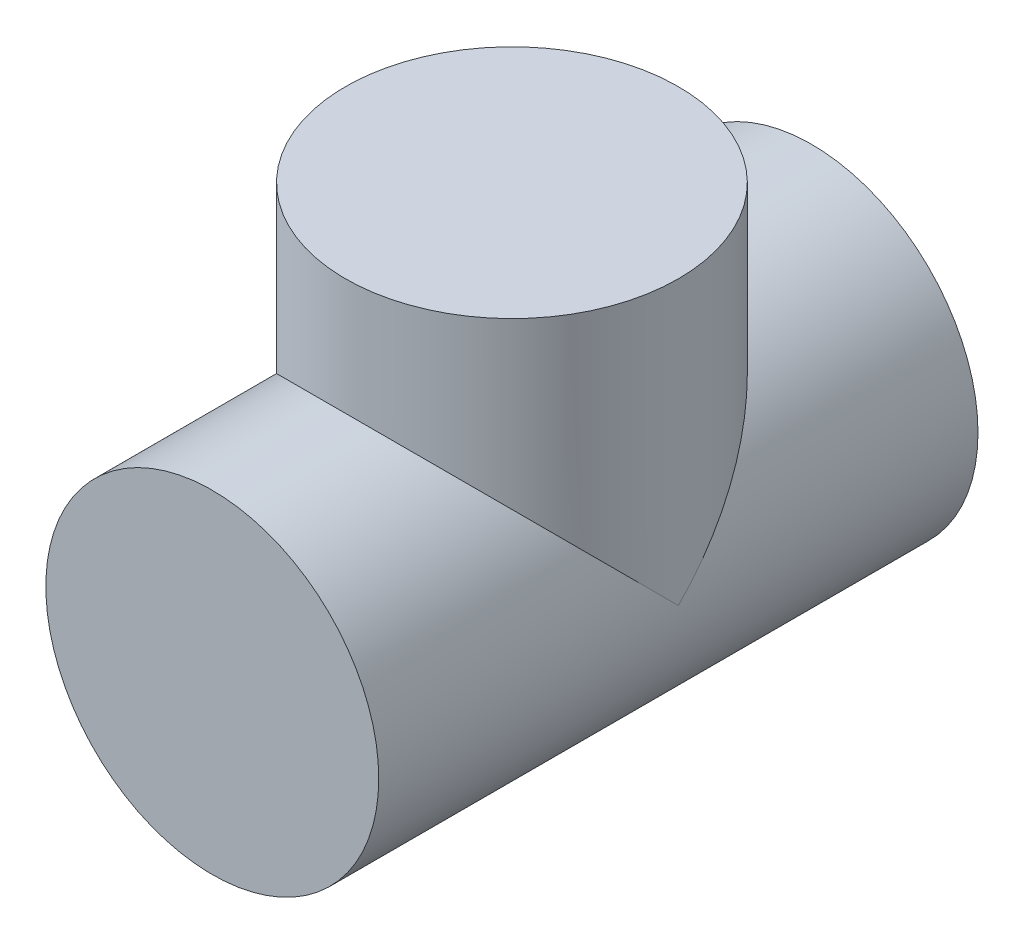
ISO-10303-21;
HEADER;
FILE_DESCRIPTION(('STEP AP214'),'2;1');
FILE_NAME('part.step','',(''),(''),'','','');
FILE_SCHEMA(('AUTOMOTIVE_DESIGN { 1 0 10303 214 1 1 1 1 }'));
ENDSEC;
DATA;
#1=APPLICATION_CONTEXT('core data for automotive mechanical design processes');
#2=APPLICATION_PROTOCOL_DEFINITION('international standard','automotive_design',2000,#1);
#3=PRODUCT_CONTEXT('',#1,'mechanical');
#4=PRODUCT('Part','Part','',(#3));
#5=PRODUCT_RELATED_PRODUCT_CATEGORY('part','',(#4));
#6=PRODUCT_DEFINITION_FORMATION('','',#4);
#7=PRODUCT_DEFINITION_CONTEXT('part definition',#1,'design');
#8=PRODUCT_DEFINITION('design','',#6,#7);
#9=PRODUCT_DEFINITION_SHAPE('','',#8);
#10=(LENGTH_UNIT() NAMED_UNIT(*) SI_UNIT(.MILLI.,.METRE.));
#11=(NAMED_UNIT(*) PLANE_ANGLE_UNIT() SI_UNIT($,.RADIAN.));
#12=(NAMED_UNIT(*) SI_UNIT($,.STERADIAN.) SOLID_ANGLE_UNIT());
#13=UNCERTAINTY_MEASURE_WITH_UNIT(LENGTH_MEASURE(1.E-05),#10,'distance_accuracy_value','');
#14=(GEOMETRIC_REPRESENTATION_CONTEXT(3) GLOBAL_UNCERTAINTY_ASSIGNED_CONTEXT((#13)) GLOBAL_UNIT_ASSIGNED_CONTEXT((#10,
#11,#12)) REPRESENTATION_CONTEXT('',''));
#15=CARTESIAN_POINT('',(0.,0.,0.));
#16=DIRECTION('',(0.,0.,1.));
#17=DIRECTION('',(1.,0.,0.));
#18=AXIS2_PLACEMENT_3D('',#15,#16,#17);
#19=CARTESIAN_POINT('',(0.,-110.1,-45.));
#20=DIRECTION('',(0.,1.,0.));
#21=DIRECTION('',(0.,0.,1.));
#22=AXIS2_PLACEMENT_3D('',#19,#20,#21);
#23=CYLINDRICAL_SURFACE('',#22,50.);
#24=CARTESIAN_POINT('',(0.,85.,-45.));
#25=DIRECTION('',(0.,-1.,0.));
#26=DIRECTION('',(1.,0.,0.));
#27=AXIS2_PLACEMENT_3D('',#24,#25,#26);
#28=CIRCLE('',#27,50.);
#29=CARTESIAN_POINT('',(50.,85.,-45.));
#30=VERTEX_POINT('',#29);
#31=EDGE_CURVE('E45',#30,#30,#28,.T.);
#32=ORIENTED_EDGE('',*,*,#31,.T.);
#33=EDGE_LOOP('',(#32));
#34=FACE_BOUND('',#33,.T.);
#35=CARTESIAN_POINT('',(0.,0.,-45.));
#36=DIRECTION('',(0.,0.707106781186547,0.707106781186547));
#37=DIRECTION('',(0.,-0.707106781186548,0.707106781186548));
#38=AXIS2_PLACEMENT_3D('',#35,#36,#37);
#39=ELLIPSE('',#38,70.7106781186548,50.);
#40=CARTESIAN_POINT('',(50.,0.,-45.));
#41=VERTEX_POINT('',#40);
#42=CARTESIAN_POINT('',(-50.,0.,-45.));
#43=VERTEX_POINT('',#42);
#44=EDGE_CURVE('E60',#41,#43,#39,.T.);
#45=ORIENTED_EDGE('',*,*,#44,.T.);
#46=CARTESIAN_POINT('',(0.,0.,-45.));
#47=DIRECTION('',(0.,0.707106781186547,-0.707106781186547));
#48=DIRECTION('',(0.,-0.707106781186548,-0.707106781186548));
#49=AXIS2_PLACEMENT_3D('',#46,#47,#48);
#50=ELLIPSE('',#49,70.7106781186548,50.);
#51=EDGE_CURVE('E11',#43,#41,#50,.T.);
#52=ORIENTED_EDGE('',*,*,#51,.T.);
#53=EDGE_LOOP('',(#45,#52));
#54=FACE_BOUND('',#53,.T.);
#55=ADVANCED_FACE('F41',(#34,#54),#23,.T.);
#56=CARTESIAN_POINT('',(0.,85.,-45.));
#57=DIRECTION('',(0.,-1.,0.));
#58=DIRECTION('',(1.,0.,0.));
#59=AXIS2_PLACEMENT_3D('',#56,#57,#58);
#60=PLANE('',#59);
#61=ORIENTED_EDGE('',*,*,#31,.F.);
#62=EDGE_LOOP('',(#61));
#63=FACE_BOUND('',#62,.T.);
#64=ADVANCED_FACE('F43',(#63),#60,.F.);
#65=CARTESIAN_POINT('',(0.,0.,45.));
#66=DIRECTION('',(0.,0.,1.));
#67=DIRECTION('',(1.,0.,0.));
#68=AXIS2_PLACEMENT_3D('',#65,#66,#67);
#69=PLANE('',#68);
#70=CARTESIAN_POINT('',(0.,0.,45.));
#71=DIRECTION('',(0.,0.,1.));
#72=DIRECTION('',(1.,0.,0.));
#73=AXIS2_PLACEMENT_3D('',#70,#71,#72);
#74=CIRCLE('',#73,50.);
#75=CARTESIAN_POINT('',(50.,0.,45.));
#76=VERTEX_POINT('',#75);
#77=EDGE_CURVE('E51',#76,#76,#74,.T.);
#78=ORIENTED_EDGE('',*,*,#77,.T.);
#79=EDGE_LOOP('',(#78));
#80=FACE_BOUND('',#79,.T.);
#81=ADVANCED_FACE('F74',(#80),#69,.T.);
#82=CARTESIAN_POINT('',(0.,0.,45.));
#83=DIRECTION('',(0.,0.,-1.));
#84=DIRECTION('',(-1.,0.,0.));
#85=AXIS2_PLACEMENT_3D('',#82,#83,#84);
#86=CYLINDRICAL_SURFACE('',#85,50.);
#87=ORIENTED_EDGE('',*,*,#51,.F.);
#88=ORIENTED_EDGE('',*,*,#44,.F.);
#89=EDGE_LOOP('',(#87,#88));
#90=FACE_BOUND('',#89,.T.);
#91=ORIENTED_EDGE('',*,*,#77,.F.);
#92=EDGE_LOOP('',(#91));
#93=FACE_BOUND('',#92,.T.);
#94=CARTESIAN_POINT('',(0.,0.,-135.));
#95=DIRECTION('',(0.,0.,1.));
#96=DIRECTION('',(1.,0.,0.));
#97=AXIS2_PLACEMENT_3D('',#94,#95,#96);
#98=CIRCLE('',#97,50.);
#99=CARTESIAN_POINT('',(50.,0.,-135.));
#100=VERTEX_POINT('',#99);
#101=EDGE_CURVE('E62',#100,#100,#98,.F.);
#102=ORIENTED_EDGE('',*,*,#101,.F.);
#103=EDGE_LOOP('',(#102));
#104=FACE_BOUND('',#103,.T.);
#105=ADVANCED_FACE('F58',(#90,#93,#104),#86,.T.);
#106=CARTESIAN_POINT('',(0.,0.,-135.));
#107=DIRECTION('',(0.,0.,-1.));
#108=DIRECTION('',(1.,0.,0.));
#109=AXIS2_PLACEMENT_3D('',#106,#107,#108);
#110=PLANE('',#109);
#111=ORIENTED_EDGE('',*,*,#101,.T.);
#112=EDGE_LOOP('',(#111));
#113=FACE_BOUND('',#112,.T.);
#114=ADVANCED_FACE('F77',(#113),#110,.T.);
#115=CLOSED_SHELL('',(#55,#64,#81,#105,#114));
#116=MANIFOLD_SOLID_BREP('B2',#115);
#117=ADVANCED_BREP_SHAPE_REPRESENTATION('',(#18,#116),#14);
#118=SHAPE_DEFINITION_REPRESENTATION(#9,#117);
ENDSEC;
END-ISO-10303-21;
